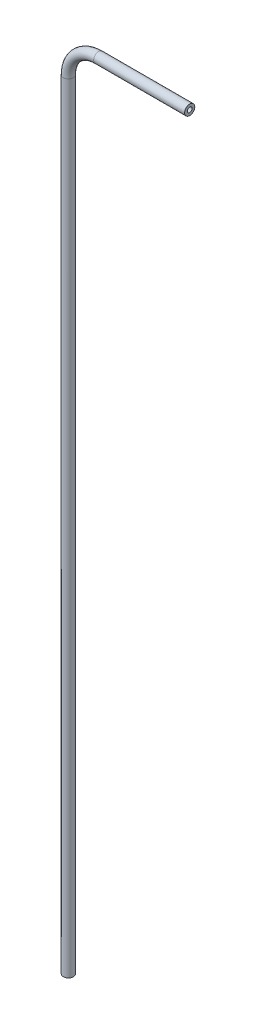
ISO-10303-21;
HEADER;
FILE_DESCRIPTION(('STEP AP214'),'2;1');
FILE_NAME('part.step','',(''),(''),'','','');
FILE_SCHEMA(('AUTOMOTIVE_DESIGN { 1 0 10303 214 1 1 1 1 }'));
ENDSEC;
DATA;
#1=APPLICATION_CONTEXT('core data for automotive mechanical design processes');
#2=APPLICATION_PROTOCOL_DEFINITION('international standard','automotive_design',2000,#1);
#3=PRODUCT_CONTEXT('',#1,'mechanical');
#4=PRODUCT('Part','Part','',(#3));
#5=PRODUCT_RELATED_PRODUCT_CATEGORY('part','',(#4));
#6=PRODUCT_DEFINITION_FORMATION('','',#4);
#7=PRODUCT_DEFINITION_CONTEXT('part definition',#1,'design');
#8=PRODUCT_DEFINITION('design','',#6,#7);
#9=PRODUCT_DEFINITION_SHAPE('','',#8);
#10=(LENGTH_UNIT() NAMED_UNIT(*) SI_UNIT(.MILLI.,.METRE.));
#11=(NAMED_UNIT(*) PLANE_ANGLE_UNIT() SI_UNIT($,.RADIAN.));
#12=(NAMED_UNIT(*) SI_UNIT($,.STERADIAN.) SOLID_ANGLE_UNIT());
#13=UNCERTAINTY_MEASURE_WITH_UNIT(LENGTH_MEASURE(1.E-05),#10,'distance_accuracy_value','');
#14=(GEOMETRIC_REPRESENTATION_CONTEXT(3) GLOBAL_UNCERTAINTY_ASSIGNED_CONTEXT((#13)) GLOBAL_UNIT_ASSIGNED_CONTEXT((#10,
#11,#12)) REPRESENTATION_CONTEXT('',''));
#15=CARTESIAN_POINT('',(0.,0.,0.));
#16=DIRECTION('',(0.,0.,1.));
#17=DIRECTION('',(1.,0.,0.));
#18=AXIS2_PLACEMENT_3D('',#15,#16,#17);
#19=CARTESIAN_POINT('',(0.,-490.472317880795,0.));
#20=DIRECTION('',(0.,1.,0.));
#21=DIRECTION('',(0.,0.,1.));
#22=AXIS2_PLACEMENT_3D('',#19,#20,#21);
#23=CYLINDRICAL_SURFACE('',#22,3.175);
#24=CARTESIAN_POINT('',(0.,-1.52231788079482,0.));
#25=DIRECTION('',(0.,1.,0.));
#26=DIRECTION('',(0.,0.,-1.));
#27=AXIS2_PLACEMENT_3D('',#24,#25,#26);
#28=CIRCLE('',#27,3.175);
#29=CARTESIAN_POINT('',(-3.175,-1.52231788079484,0.));
#30=VERTEX_POINT('',#29);
#31=EDGE_CURVE('E80',#30,#30,#28,.T.);
#32=ORIENTED_EDGE('',*,*,#31,.F.);
#33=EDGE_LOOP('',(#32));
#34=FACE_BOUND('',#33,.T.);
#35=CARTESIAN_POINT('',(0.,-490.472317880795,0.));
#36=DIRECTION('',(0.,1.,0.));
#37=DIRECTION('',(0.,0.,-1.));
#38=AXIS2_PLACEMENT_3D('',#35,#36,#37);
#39=CIRCLE('',#38,3.175);
#40=CARTESIAN_POINT('',(0.,-490.472317880795,-3.175));
#41=VERTEX_POINT('',#40);
#42=EDGE_CURVE('E49',#41,#41,#39,.T.);
#43=ORIENTED_EDGE('',*,*,#42,.T.);
#44=EDGE_LOOP('',(#43));
#45=FACE_BOUND('',#44,.T.);
#46=ADVANCED_FACE('F34',(#34,#45),#23,.T.);
#47=CARTESIAN_POINT('',(19.05,-1.52231788079469,0.));
#48=DIRECTION('',(0.,0.,-1.));
#49=DIRECTION('',(-1.,0.,0.));
#50=AXIS2_PLACEMENT_3D('',#47,#48,#49);
#51=TOROIDAL_SURFACE('',#50,19.05,3.175);
#52=CARTESIAN_POINT('',(19.05,17.5276821192058,0.));
#53=DIRECTION('',(1.,0.,0.));
#54=DIRECTION('',(0.,0.,-1.));
#55=AXIS2_PLACEMENT_3D('',#52,#53,#54);
#56=CIRCLE('',#55,3.175);
#57=CARTESIAN_POINT('',(19.05,20.7026821192053,0.));
#58=VERTEX_POINT('',#57);
#59=EDGE_CURVE('E38',#58,#58,#56,.T.);
#60=CARTESIAN_POINT('',(19.05,-1.52231788079469,0.));
#61=DIRECTION('',(0.,0.,-1.));
#62=DIRECTION('',(-1.,0.,0.));
#63=AXIS2_PLACEMENT_3D('',#60,#61,#62);
#64=CIRCLE('',#63,22.225);
#65=EDGE_CURVE('',#30,#58,#64,.T.);
#66=ORIENTED_EDGE('',*,*,#31,.T.);
#67=ORIENTED_EDGE('',*,*,#59,.F.);
#68=ORIENTED_EDGE('',*,*,#65,.T.);
#69=ORIENTED_EDGE('',*,*,#65,.F.);
#70=EDGE_LOOP('',(#66,#68,#67,#69));
#71=FACE_BOUND('',#70,.T.);
#72=ADVANCED_FACE('F88',(#71),#51,.T.);
#73=CARTESIAN_POINT('',(19.0500000000001,17.5276821192053,0.));
#74=DIRECTION('',(1.,0.,0.));
#75=DIRECTION('',(0.,0.,-1.));
#76=AXIS2_PLACEMENT_3D('',#73,#74,#75);
#77=CYLINDRICAL_SURFACE('',#76,3.175);
#78=CARTESIAN_POINT('',(76.2,17.5276821192053,0.));
#79=DIRECTION('',(1.,0.,0.));
#80=DIRECTION('',(0.,0.,-1.));
#81=AXIS2_PLACEMENT_3D('',#78,#79,#80);
#82=CIRCLE('',#81,3.175);
#83=CARTESIAN_POINT('',(76.2,17.5276821192053,-3.175));
#84=VERTEX_POINT('',#83);
#85=EDGE_CURVE('E54',#84,#84,#82,.T.);
#86=ORIENTED_EDGE('',*,*,#85,.F.);
#87=EDGE_LOOP('',(#86));
#88=FACE_BOUND('',#87,.T.);
#89=ORIENTED_EDGE('',*,*,#59,.T.);
#90=EDGE_LOOP('',(#89));
#91=FACE_BOUND('',#90,.T.);
#92=ADVANCED_FACE('F36',(#88,#91),#77,.T.);
#93=CARTESIAN_POINT('',(0.,-490.472317880795,0.));
#94=DIRECTION('',(0.,1.,0.));
#95=DIRECTION('',(0.,0.,-1.));
#96=AXIS2_PLACEMENT_3D('',#93,#94,#95);
#97=PLANE('',#96);
#98=CARTESIAN_POINT('',(0.,-490.472317880795,0.));
#99=DIRECTION('',(0.,1.,0.));
#100=DIRECTION('',(0.,0.,-1.));
#101=AXIS2_PLACEMENT_3D('',#98,#99,#100);
#102=CIRCLE('',#101,1.524);
#103=CARTESIAN_POINT('',(0.,-490.472317880795,-1.524));
#104=VERTEX_POINT('',#103);
#105=EDGE_CURVE('E75',#104,#104,#102,.F.);
#106=ORIENTED_EDGE('',*,*,#105,.F.);
#107=EDGE_LOOP('',(#106));
#108=FACE_BOUND('',#107,.T.);
#109=ORIENTED_EDGE('',*,*,#42,.F.);
#110=EDGE_LOOP('',(#109));
#111=FACE_BOUND('',#110,.T.);
#112=ADVANCED_FACE('F94',(#108,#111),#97,.F.);
#113=CARTESIAN_POINT('',(76.2,17.5276821192053,0.));
#114=DIRECTION('',(1.,0.,0.));
#115=DIRECTION('',(0.,0.,-1.));
#116=AXIS2_PLACEMENT_3D('',#113,#114,#115);
#117=PLANE('',#116);
#118=CARTESIAN_POINT('',(76.2,17.5276821192053,0.));
#119=DIRECTION('',(1.,0.,0.));
#120=DIRECTION('',(0.,0.,-1.));
#121=AXIS2_PLACEMENT_3D('',#118,#119,#120);
#122=CIRCLE('',#121,1.524);
#123=CARTESIAN_POINT('',(76.2,17.5276821192053,-1.524));
#124=VERTEX_POINT('',#123);
#125=EDGE_CURVE('E11',#124,#124,#122,.F.);
#126=ORIENTED_EDGE('',*,*,#125,.T.);
#127=EDGE_LOOP('',(#126));
#128=FACE_BOUND('',#127,.T.);
#129=ORIENTED_EDGE('',*,*,#85,.T.);
#130=EDGE_LOOP('',(#129));
#131=FACE_BOUND('',#130,.T.);
#132=ADVANCED_FACE('F61',(#128,#131),#117,.T.);
#133=CARTESIAN_POINT('',(0.,-490.472317880795,0.));
#134=DIRECTION('',(0.,1.,0.));
#135=DIRECTION('',(0.,0.,1.));
#136=AXIS2_PLACEMENT_3D('',#133,#134,#135);
#137=CYLINDRICAL_SURFACE('',#136,1.524);
#138=CARTESIAN_POINT('',(0.,-1.52231788079482,0.));
#139=DIRECTION('',(0.,1.,0.));
#140=DIRECTION('',(0.,0.,-1.));
#141=AXIS2_PLACEMENT_3D('',#138,#139,#140);
#142=CIRCLE('',#141,1.524);
#143=CARTESIAN_POINT('',(-1.524,-1.52231788079483,0.));
#144=VERTEX_POINT('',#143);
#145=EDGE_CURVE('E72',#144,#144,#142,.F.);
#146=ORIENTED_EDGE('',*,*,#145,.F.);
#147=EDGE_LOOP('',(#146));
#148=FACE_BOUND('',#147,.T.);
#149=ORIENTED_EDGE('',*,*,#105,.T.);
#150=EDGE_LOOP('',(#149));
#151=FACE_BOUND('',#150,.T.);
#152=ADVANCED_FACE('F102',(#148,#151),#137,.F.);
#153=CARTESIAN_POINT('',(19.05,-1.52231788079469,0.));
#154=DIRECTION('',(0.,0.,-1.));
#155=DIRECTION('',(-1.,0.,0.));
#156=AXIS2_PLACEMENT_3D('',#153,#154,#155);
#157=TOROIDAL_SURFACE('',#156,19.05,1.524);
#158=CARTESIAN_POINT('',(19.05,17.5276821192058,0.));
#159=DIRECTION('',(1.,0.,0.));
#160=DIRECTION('',(0.,0.,-1.));
#161=AXIS2_PLACEMENT_3D('',#158,#159,#160);
#162=CIRCLE('',#161,1.524);
#163=CARTESIAN_POINT('',(19.05,19.0516821192053,0.));
#164=VERTEX_POINT('',#163);
#165=EDGE_CURVE('E43',#164,#164,#162,.F.);
#166=CARTESIAN_POINT('',(19.05,-1.52231788079469,0.));
#167=DIRECTION('',(0.,0.,-1.));
#168=DIRECTION('',(-1.,0.,0.));
#169=AXIS2_PLACEMENT_3D('',#166,#167,#168);
#170=CIRCLE('',#169,20.574);
#171=EDGE_CURVE('',#144,#164,#170,.T.);
#172=ORIENTED_EDGE('',*,*,#145,.T.);
#173=ORIENTED_EDGE('',*,*,#165,.F.);
#174=ORIENTED_EDGE('',*,*,#171,.T.);
#175=ORIENTED_EDGE('',*,*,#171,.F.);
#176=EDGE_LOOP('',(#172,#174,#173,#175));
#177=FACE_BOUND('',#176,.T.);
#178=ADVANCED_FACE('F67',(#177),#157,.F.);
#179=CARTESIAN_POINT('',(19.0500000000001,17.5276821192053,0.));
#180=DIRECTION('',(1.,0.,0.));
#181=DIRECTION('',(0.,0.,-1.));
#182=AXIS2_PLACEMENT_3D('',#179,#180,#181);
#183=CYLINDRICAL_SURFACE('',#182,1.524);
#184=ORIENTED_EDGE('',*,*,#125,.F.);
#185=EDGE_LOOP('',(#184));
#186=FACE_BOUND('',#185,.T.);
#187=ORIENTED_EDGE('',*,*,#165,.T.);
#188=EDGE_LOOP('',(#187));
#189=FACE_BOUND('',#188,.T.);
#190=ADVANCED_FACE('F64',(#186,#189),#183,.F.);
#191=CLOSED_SHELL('',(#46,#72,#92,#112,#132,#152,#178,#190));
#192=MANIFOLD_SOLID_BREP('B2',#191);
#193=ADVANCED_BREP_SHAPE_REPRESENTATION('',(#18,#192),#14);
#194=SHAPE_DEFINITION_REPRESENTATION(#9,#193);
ENDSEC;
END-ISO-10303-21;
